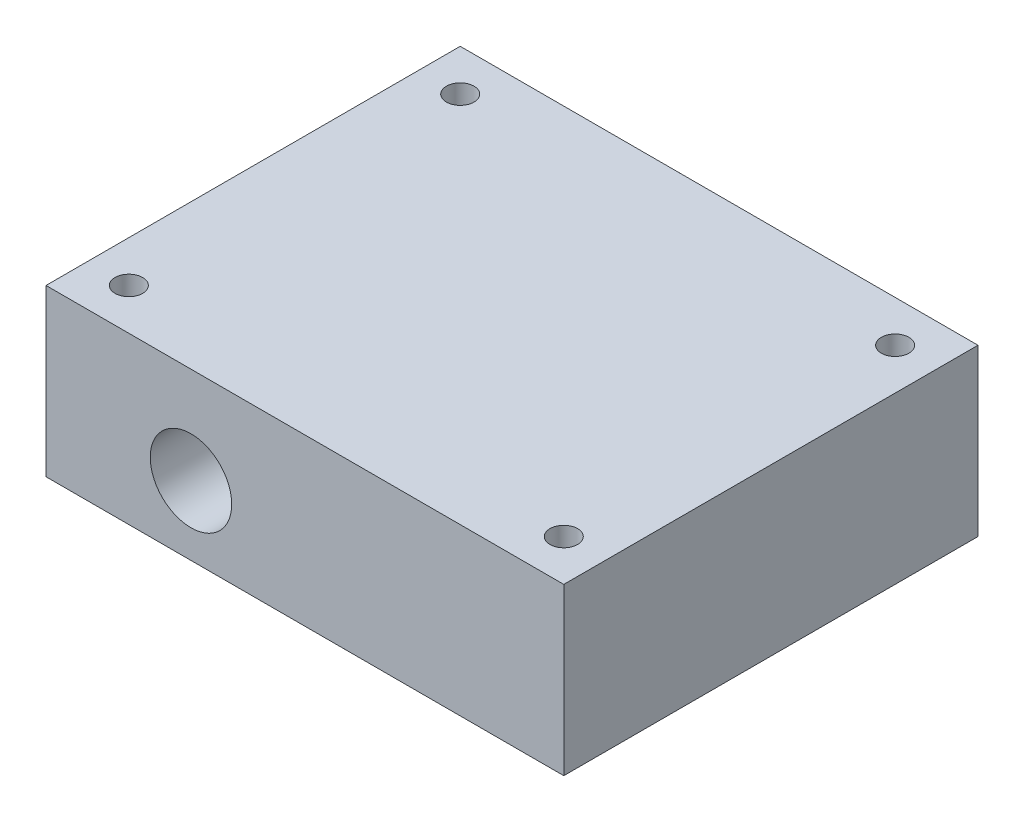
ISO-10303-21;
HEADER;
FILE_DESCRIPTION(('STEP AP214'),'2;1');
FILE_NAME('part.step','',(''),(''),'','','');
FILE_SCHEMA(('AUTOMOTIVE_DESIGN { 1 0 10303 214 1 1 1 1 }'));
ENDSEC;
DATA;
#1=APPLICATION_CONTEXT('core data for automotive mechanical design processes');
#2=APPLICATION_PROTOCOL_DEFINITION('international standard','automotive_design',2000,#1);
#3=PRODUCT_CONTEXT('',#1,'mechanical');
#4=PRODUCT('Part','Part','',(#3));
#5=PRODUCT_RELATED_PRODUCT_CATEGORY('part','',(#4));
#6=PRODUCT_DEFINITION_FORMATION('','',#4);
#7=PRODUCT_DEFINITION_CONTEXT('part definition',#1,'design');
#8=PRODUCT_DEFINITION('design','',#6,#7);
#9=PRODUCT_DEFINITION_SHAPE('','',#8);
#10=(LENGTH_UNIT() NAMED_UNIT(*) SI_UNIT(.MILLI.,.METRE.));
#11=(NAMED_UNIT(*) PLANE_ANGLE_UNIT() SI_UNIT($,.RADIAN.));
#12=(NAMED_UNIT(*) SI_UNIT($,.STERADIAN.) SOLID_ANGLE_UNIT());
#13=UNCERTAINTY_MEASURE_WITH_UNIT(LENGTH_MEASURE(1.E-05),#10,'distance_accuracy_value','');
#14=(GEOMETRIC_REPRESENTATION_CONTEXT(3) GLOBAL_UNCERTAINTY_ASSIGNED_CONTEXT((#13)) GLOBAL_UNIT_ASSIGNED_CONTEXT((#10,
#11,#12)) REPRESENTATION_CONTEXT('',''));
#15=CARTESIAN_POINT('',(0.,0.,0.));
#16=DIRECTION('',(0.,0.,1.));
#17=DIRECTION('',(1.,0.,0.));
#18=AXIS2_PLACEMENT_3D('',#15,#16,#17);
#19=CARTESIAN_POINT('',(0.,24.,0.));
#20=DIRECTION('',(1.,0.,0.));
#21=DIRECTION('',(0.,0.,-1.));
#22=AXIS2_PLACEMENT_3D('',#19,#20,#21);
#23=PLANE('',#22);
#24=DIRECTION('',(0.,0.,1.));
#25=VECTOR('',#24,1.);
#26=CARTESIAN_POINT('',(0.,0.,0.));
#27=LINE('',#26,#25);
#28=CARTESIAN_POINT('',(0.,0.,-60.));
#29=VERTEX_POINT('',#28);
#30=CARTESIAN_POINT('',(0.,0.,0.));
#31=VERTEX_POINT('',#30);
#32=EDGE_CURVE('E154',#29,#31,#27,.T.);
#33=ORIENTED_EDGE('',*,*,#32,.T.);
#34=DIRECTION('',(0.,-1.,0.));
#35=VECTOR('',#34,1.);
#36=CARTESIAN_POINT('',(0.,24.,0.));
#37=LINE('',#36,#35);
#38=CARTESIAN_POINT('',(0.,24.,0.));
#39=VERTEX_POINT('',#38);
#40=EDGE_CURVE('E11',#39,#31,#37,.T.);
#41=ORIENTED_EDGE('',*,*,#40,.F.);
#42=DIRECTION('',(0.,0.,1.));
#43=VECTOR('',#42,1.);
#44=CARTESIAN_POINT('',(0.,24.,0.));
#45=LINE('',#44,#43);
#46=CARTESIAN_POINT('',(0.,24.,-60.));
#47=VERTEX_POINT('',#46);
#48=EDGE_CURVE('E165',#47,#39,#45,.T.);
#49=ORIENTED_EDGE('',*,*,#48,.F.);
#50=DIRECTION('',(0.,-1.,0.));
#51=VECTOR('',#50,1.);
#52=CARTESIAN_POINT('',(0.,24.,-60.));
#53=LINE('',#52,#51);
#54=EDGE_CURVE('E169',#47,#29,#53,.T.);
#55=ORIENTED_EDGE('',*,*,#54,.T.);
#56=EDGE_LOOP('',(#33,#41,#49,#55));
#57=FACE_BOUND('',#56,.T.);
#58=ADVANCED_FACE('F33',(#57),#23,.F.);
#59=CARTESIAN_POINT('',(0.,24.,0.));
#60=DIRECTION('',(0.,0.,-1.));
#61=DIRECTION('',(-1.,0.,0.));
#62=AXIS2_PLACEMENT_3D('',#59,#60,#61);
#63=PLANE('',#62);
#64=CARTESIAN_POINT('',(21.,10.,0.));
#65=DIRECTION('',(0.,0.,1.));
#66=DIRECTION('',(1.,0.,0.));
#67=AXIS2_PLACEMENT_3D('',#64,#65,#66);
#68=CIRCLE('',#67,5.9);
#69=CARTESIAN_POINT('',(26.9,10.,0.));
#70=VERTEX_POINT('',#69);
#71=EDGE_CURVE('E119',#70,#70,#68,.T.);
#72=ORIENTED_EDGE('',*,*,#71,.F.);
#73=EDGE_LOOP('',(#72));
#74=FACE_BOUND('',#73,.T.);
#75=DIRECTION('',(1.,0.,0.));
#76=VECTOR('',#75,1.);
#77=CARTESIAN_POINT('',(0.,0.,0.));
#78=LINE('',#77,#76);
#79=CARTESIAN_POINT('',(75.,0.,0.));
#80=VERTEX_POINT('',#79);
#81=EDGE_CURVE('E145',#31,#80,#78,.T.);
#82=ORIENTED_EDGE('',*,*,#81,.T.);
#83=DIRECTION('',(0.,-1.,0.));
#84=VECTOR('',#83,1.);
#85=CARTESIAN_POINT('',(75.,24.,0.));
#86=LINE('',#85,#84);
#87=CARTESIAN_POINT('',(75.,24.,0.));
#88=VERTEX_POINT('',#87);
#89=EDGE_CURVE('E40',#88,#80,#86,.T.);
#90=ORIENTED_EDGE('',*,*,#89,.F.);
#91=DIRECTION('',(1.,0.,0.));
#92=VECTOR('',#91,1.);
#93=CARTESIAN_POINT('',(0.,24.,0.));
#94=LINE('',#93,#92);
#95=EDGE_CURVE('E181',#39,#88,#94,.T.);
#96=ORIENTED_EDGE('',*,*,#95,.F.);
#97=ORIENTED_EDGE('',*,*,#40,.T.);
#98=EDGE_LOOP('',(#82,#90,#96,#97));
#99=FACE_BOUND('',#98,.T.);
#100=ADVANCED_FACE('F140',(#74,#99),#63,.F.);
#101=CARTESIAN_POINT('',(75.,24.,0.));
#102=DIRECTION('',(-1.,0.,0.));
#103=DIRECTION('',(0.,0.,1.));
#104=AXIS2_PLACEMENT_3D('',#101,#102,#103);
#105=PLANE('',#104);
#106=DIRECTION('',(0.,0.,-1.));
#107=VECTOR('',#106,1.);
#108=CARTESIAN_POINT('',(75.,0.,0.));
#109=LINE('',#108,#107);
#110=CARTESIAN_POINT('',(75.,0.,-60.));
#111=VERTEX_POINT('',#110);
#112=EDGE_CURVE('E153',#80,#111,#109,.T.);
#113=ORIENTED_EDGE('',*,*,#112,.T.);
#114=DIRECTION('',(0.,-1.,0.));
#115=VECTOR('',#114,1.);
#116=CARTESIAN_POINT('',(75.,24.,-60.));
#117=LINE('',#116,#115);
#118=CARTESIAN_POINT('',(75.,24.,-60.));
#119=VERTEX_POINT('',#118);
#120=EDGE_CURVE('E160',#119,#111,#117,.T.);
#121=ORIENTED_EDGE('',*,*,#120,.F.);
#122=DIRECTION('',(0.,0.,-1.));
#123=VECTOR('',#122,1.);
#124=CARTESIAN_POINT('',(75.,24.,0.));
#125=LINE('',#124,#123);
#126=EDGE_CURVE('E159',#88,#119,#125,.T.);
#127=ORIENTED_EDGE('',*,*,#126,.F.);
#128=ORIENTED_EDGE('',*,*,#89,.T.);
#129=EDGE_LOOP('',(#113,#121,#127,#128));
#130=FACE_BOUND('',#129,.T.);
#131=ADVANCED_FACE('F143',(#130),#105,.F.);
#132=CARTESIAN_POINT('',(0.,24.,-60.));
#133=DIRECTION('',(0.,0.,1.));
#134=DIRECTION('',(1.,0.,0.));
#135=AXIS2_PLACEMENT_3D('',#132,#133,#134);
#136=PLANE('',#135);
#137=DIRECTION('',(-1.,0.,0.));
#138=VECTOR('',#137,1.);
#139=CARTESIAN_POINT('',(0.,0.,-60.));
#140=LINE('',#139,#138);
#141=EDGE_CURVE('E163',#111,#29,#140,.T.);
#142=ORIENTED_EDGE('',*,*,#141,.T.);
#143=ORIENTED_EDGE('',*,*,#54,.F.);
#144=DIRECTION('',(-1.,0.,0.));
#145=VECTOR('',#144,1.);
#146=CARTESIAN_POINT('',(0.,24.,-60.));
#147=LINE('',#146,#145);
#148=EDGE_CURVE('E172',#119,#47,#147,.T.);
#149=ORIENTED_EDGE('',*,*,#148,.F.);
#150=ORIENTED_EDGE('',*,*,#120,.T.);
#151=EDGE_LOOP('',(#142,#143,#149,#150));
#152=FACE_BOUND('',#151,.T.);
#153=ADVANCED_FACE('F175',(#152),#136,.F.);
#154=CARTESIAN_POINT('',(0.,24.,0.));
#155=DIRECTION('',(0.,-1.,0.));
#156=DIRECTION('',(0.,0.,-1.));
#157=AXIS2_PLACEMENT_3D('',#154,#155,#156);
#158=PLANE('',#157);
#159=CARTESIAN_POINT('',(6.,24.,-6.));
#160=DIRECTION('',(0.,1.,0.));
#161=DIRECTION('',(0.,0.,-1.));
#162=AXIS2_PLACEMENT_3D('',#159,#160,#161);
#163=CIRCLE('',#162,2.);
#164=CARTESIAN_POINT('',(6.,24.,-8.));
#165=VERTEX_POINT('',#164);
#166=EDGE_CURVE('E368',#165,#165,#163,.T.);
#167=ORIENTED_EDGE('',*,*,#166,.F.);
#168=EDGE_LOOP('',(#167));
#169=FACE_BOUND('',#168,.T.);
#170=CARTESIAN_POINT('',(69.,24.,-54.));
#171=DIRECTION('',(0.,1.,0.));
#172=DIRECTION('',(0.,0.,-1.));
#173=AXIS2_PLACEMENT_3D('',#170,#171,#172);
#174=CIRCLE('',#173,2.00000000000001);
#175=CARTESIAN_POINT('',(69.,24.,-56.));
#176=VERTEX_POINT('',#175);
#177=EDGE_CURVE('E374',#176,#176,#174,.T.);
#178=ORIENTED_EDGE('',*,*,#177,.F.);
#179=EDGE_LOOP('',(#178));
#180=FACE_BOUND('',#179,.T.);
#181=CARTESIAN_POINT('',(69.,24.,-6.00000000000002));
#182=DIRECTION('',(0.,1.,0.));
#183=DIRECTION('',(0.,0.,1.));
#184=AXIS2_PLACEMENT_3D('',#181,#182,#183);
#185=CIRCLE('',#184,2.00000000000001);
#186=CARTESIAN_POINT('',(69.,24.,-4.00000000000001));
#187=VERTEX_POINT('',#186);
#188=EDGE_CURVE('E195',#187,#187,#185,.T.);
#189=ORIENTED_EDGE('',*,*,#188,.F.);
#190=EDGE_LOOP('',(#189));
#191=FACE_BOUND('',#190,.T.);
#192=CARTESIAN_POINT('',(6.00000000000001,24.,-54.));
#193=DIRECTION('',(0.,1.,0.));
#194=DIRECTION('',(0.,0.,1.));
#195=AXIS2_PLACEMENT_3D('',#192,#193,#194);
#196=CIRCLE('',#195,2.);
#197=CARTESIAN_POINT('',(6.00000000000001,24.,-52.));
#198=VERTEX_POINT('',#197);
#199=EDGE_CURVE('E187',#198,#198,#196,.T.);
#200=ORIENTED_EDGE('',*,*,#199,.F.);
#201=EDGE_LOOP('',(#200));
#202=FACE_BOUND('',#201,.T.);
#203=ORIENTED_EDGE('',*,*,#48,.T.);
#204=ORIENTED_EDGE('',*,*,#95,.T.);
#205=ORIENTED_EDGE('',*,*,#126,.T.);
#206=ORIENTED_EDGE('',*,*,#148,.T.);
#207=EDGE_LOOP('',(#203,#204,#205,#206));
#208=FACE_BOUND('',#207,.T.);
#209=ADVANCED_FACE('F198',(#169,#180,#191,#202,#208),#158,.F.);
#210=CARTESIAN_POINT('',(0.,0.,0.));
#211=DIRECTION('',(0.,-1.,0.));
#212=DIRECTION('',(0.,0.,-1.));
#213=AXIS2_PLACEMENT_3D('',#210,#211,#212);
#214=PLANE('',#213);
#215=DIRECTION('',(0.,0.,-1.));
#216=VECTOR('',#215,1.);
#217=CARTESIAN_POINT('',(15.,0.,-10.));
#218=LINE('',#217,#216);
#219=CARTESIAN_POINT('',(15.,0.,-10.));
#220=VERTEX_POINT('',#219);
#221=CARTESIAN_POINT('',(15.,0.,-50.));
#222=VERTEX_POINT('',#221);
#223=EDGE_CURVE('E54',#220,#222,#218,.T.);
#224=ORIENTED_EDGE('',*,*,#223,.F.);
#225=DIRECTION('',(-1.,0.,0.));
#226=VECTOR('',#225,1.);
#227=CARTESIAN_POINT('',(15.,0.,-10.));
#228=LINE('',#227,#226);
#229=CARTESIAN_POINT('',(60.,0.,-10.));
#230=VERTEX_POINT('',#229);
#231=EDGE_CURVE('E136',#230,#220,#228,.T.);
#232=ORIENTED_EDGE('',*,*,#231,.F.);
#233=DIRECTION('',(0.,0.,1.));
#234=VECTOR('',#233,1.);
#235=CARTESIAN_POINT('',(60.,0.,-10.));
#236=LINE('',#235,#234);
#237=CARTESIAN_POINT('',(60.,0.,-50.));
#238=VERTEX_POINT('',#237);
#239=EDGE_CURVE('E352',#238,#230,#236,.T.);
#240=ORIENTED_EDGE('',*,*,#239,.F.);
#241=DIRECTION('',(1.,0.,0.));
#242=VECTOR('',#241,1.);
#243=CARTESIAN_POINT('',(15.,0.,-50.));
#244=LINE('',#243,#242);
#245=EDGE_CURVE('E349',#222,#238,#244,.T.);
#246=ORIENTED_EDGE('',*,*,#245,.F.);
#247=EDGE_LOOP('',(#224,#232,#240,#246));
#248=FACE_BOUND('',#247,.T.);
#249=CARTESIAN_POINT('',(6.,0.,-6.));
#250=DIRECTION('',(0.,1.,0.));
#251=DIRECTION('',(0.,0.,-1.));
#252=AXIS2_PLACEMENT_3D('',#249,#250,#251);
#253=CIRCLE('',#252,2.);
#254=CARTESIAN_POINT('',(6.,0.,-8.));
#255=VERTEX_POINT('',#254);
#256=EDGE_CURVE('E192',#255,#255,#253,.T.);
#257=ORIENTED_EDGE('',*,*,#256,.T.);
#258=EDGE_LOOP('',(#257));
#259=FACE_BOUND('',#258,.T.);
#260=CARTESIAN_POINT('',(69.,0.,-54.));
#261=DIRECTION('',(0.,1.,0.));
#262=DIRECTION('',(0.,0.,-1.));
#263=AXIS2_PLACEMENT_3D('',#260,#261,#262);
#264=CIRCLE('',#263,2.00000000000001);
#265=CARTESIAN_POINT('',(69.,0.,-56.));
#266=VERTEX_POINT('',#265);
#267=EDGE_CURVE('E371',#266,#266,#264,.T.);
#268=ORIENTED_EDGE('',*,*,#267,.T.);
#269=EDGE_LOOP('',(#268));
#270=FACE_BOUND('',#269,.T.);
#271=CARTESIAN_POINT('',(69.,0.,-6.00000000000002));
#272=DIRECTION('',(0.,1.,0.));
#273=DIRECTION('',(0.,0.,1.));
#274=AXIS2_PLACEMENT_3D('',#271,#272,#273);
#275=CIRCLE('',#274,2.00000000000001);
#276=CARTESIAN_POINT('',(69.,0.,-4.00000000000001));
#277=VERTEX_POINT('',#276);
#278=EDGE_CURVE('E376',#277,#277,#275,.T.);
#279=ORIENTED_EDGE('',*,*,#278,.T.);
#280=EDGE_LOOP('',(#279));
#281=FACE_BOUND('',#280,.T.);
#282=CARTESIAN_POINT('',(6.00000000000001,0.,-54.));
#283=DIRECTION('',(0.,1.,0.));
#284=DIRECTION('',(0.,0.,1.));
#285=AXIS2_PLACEMENT_3D('',#282,#283,#284);
#286=CIRCLE('',#285,2.);
#287=CARTESIAN_POINT('',(6.00000000000001,0.,-52.));
#288=VERTEX_POINT('',#287);
#289=EDGE_CURVE('E184',#288,#288,#286,.T.);
#290=ORIENTED_EDGE('',*,*,#289,.T.);
#291=EDGE_LOOP('',(#290));
#292=FACE_BOUND('',#291,.T.);
#293=ORIENTED_EDGE('',*,*,#32,.F.);
#294=ORIENTED_EDGE('',*,*,#141,.F.);
#295=ORIENTED_EDGE('',*,*,#112,.F.);
#296=ORIENTED_EDGE('',*,*,#81,.F.);
#297=EDGE_LOOP('',(#293,#294,#295,#296));
#298=FACE_BOUND('',#297,.T.);
#299=ADVANCED_FACE('F162',(#248,#259,#270,#281,#292,#298),#214,.T.);
#300=CARTESIAN_POINT('',(6.00000000000001,0.,-54.));
#301=DIRECTION('',(0.,1.,0.));
#302=DIRECTION('',(0.,0.,1.));
#303=AXIS2_PLACEMENT_3D('',#300,#301,#302);
#304=CYLINDRICAL_SURFACE('',#303,2.);
#305=ORIENTED_EDGE('',*,*,#289,.F.);
#306=EDGE_LOOP('',(#305));
#307=FACE_BOUND('',#306,.T.);
#308=ORIENTED_EDGE('',*,*,#199,.T.);
#309=EDGE_LOOP('',(#308));
#310=FACE_BOUND('',#309,.T.);
#311=ADVANCED_FACE('F234',(#307,#310),#304,.F.);
#312=CARTESIAN_POINT('',(69.,0.,-6.00000000000002));
#313=DIRECTION('',(0.,1.,0.));
#314=DIRECTION('',(0.,0.,1.));
#315=AXIS2_PLACEMENT_3D('',#312,#313,#314);
#316=CYLINDRICAL_SURFACE('',#315,2.00000000000001);
#317=ORIENTED_EDGE('',*,*,#278,.F.);
#318=EDGE_LOOP('',(#317));
#319=FACE_BOUND('',#318,.T.);
#320=ORIENTED_EDGE('',*,*,#188,.T.);
#321=EDGE_LOOP('',(#320));
#322=FACE_BOUND('',#321,.T.);
#323=ADVANCED_FACE('F243',(#319,#322),#316,.F.);
#324=CARTESIAN_POINT('',(69.,0.,-54.));
#325=DIRECTION('',(0.,1.,0.));
#326=DIRECTION('',(0.,0.,1.));
#327=AXIS2_PLACEMENT_3D('',#324,#325,#326);
#328=CYLINDRICAL_SURFACE('',#327,2.00000000000001);
#329=ORIENTED_EDGE('',*,*,#267,.F.);
#330=EDGE_LOOP('',(#329));
#331=FACE_BOUND('',#330,.T.);
#332=ORIENTED_EDGE('',*,*,#177,.T.);
#333=EDGE_LOOP('',(#332));
#334=FACE_BOUND('',#333,.T.);
#335=ADVANCED_FACE('F251',(#331,#334),#328,.F.);
#336=CARTESIAN_POINT('',(6.,0.,-6.));
#337=DIRECTION('',(0.,1.,0.));
#338=DIRECTION('',(0.,0.,1.));
#339=AXIS2_PLACEMENT_3D('',#336,#337,#338);
#340=CYLINDRICAL_SURFACE('',#339,2.);
#341=ORIENTED_EDGE('',*,*,#256,.F.);
#342=EDGE_LOOP('',(#341));
#343=FACE_BOUND('',#342,.T.);
#344=ORIENTED_EDGE('',*,*,#166,.T.);
#345=EDGE_LOOP('',(#344));
#346=FACE_BOUND('',#345,.T.);
#347=ADVANCED_FACE('F259',(#343,#346),#340,.F.);
#348=CARTESIAN_POINT('',(15.,15.,-10.));
#349=DIRECTION('',(-1.,0.,0.));
#350=DIRECTION('',(0.,0.,1.));
#351=AXIS2_PLACEMENT_3D('',#348,#349,#350);
#352=PLANE('',#351);
#353=ORIENTED_EDGE('',*,*,#223,.T.);
#354=DIRECTION('',(0.,-1.,0.));
#355=VECTOR('',#354,1.);
#356=CARTESIAN_POINT('',(15.,15.,-50.));
#357=LINE('',#356,#355);
#358=CARTESIAN_POINT('',(15.,15.,-50.));
#359=VERTEX_POINT('',#358);
#360=EDGE_CURVE('E126',#359,#222,#357,.T.);
#361=ORIENTED_EDGE('',*,*,#360,.F.);
#362=DIRECTION('',(0.,0.,-1.));
#363=VECTOR('',#362,1.);
#364=CARTESIAN_POINT('',(15.,15.,-10.));
#365=LINE('',#364,#363);
#366=CARTESIAN_POINT('',(15.,15.,-10.));
#367=VERTEX_POINT('',#366);
#368=EDGE_CURVE('E132',#367,#359,#365,.T.);
#369=ORIENTED_EDGE('',*,*,#368,.F.);
#370=DIRECTION('',(0.,-1.,0.));
#371=VECTOR('',#370,1.);
#372=CARTESIAN_POINT('',(15.,15.,-10.));
#373=LINE('',#372,#371);
#374=EDGE_CURVE('E361',#367,#220,#373,.T.);
#375=ORIENTED_EDGE('',*,*,#374,.T.);
#376=EDGE_LOOP('',(#353,#361,#369,#375));
#377=FACE_BOUND('',#376,.T.);
#378=ADVANCED_FACE('F266',(#377),#352,.F.);
#379=CARTESIAN_POINT('',(15.,15.,-10.));
#380=DIRECTION('',(0.,0.,1.));
#381=DIRECTION('',(1.,0.,0.));
#382=AXIS2_PLACEMENT_3D('',#379,#380,#381);
#383=PLANE('',#382);
#384=DIRECTION('',(-1.,0.,0.));
#385=VECTOR('',#384,1.);
#386=CARTESIAN_POINT('',(15.,15.,-10.));
#387=LINE('',#386,#385);
#388=CARTESIAN_POINT('',(17.8679080473268,15.,-10.));
#389=VERTEX_POINT('',#388);
#390=EDGE_CURVE('E106',#389,#367,#387,.T.);
#391=ORIENTED_EDGE('',*,*,#390,.F.);
#392=CARTESIAN_POINT('',(21.,10.,-10.));
#393=DIRECTION('',(0.,0.,1.));
#394=DIRECTION('',(1.,0.,0.));
#395=AXIS2_PLACEMENT_3D('',#392,#393,#394);
#396=CIRCLE('',#395,5.9);
#397=CARTESIAN_POINT('',(24.1320919526732,15.,-10.));
#398=VERTEX_POINT('',#397);
#399=EDGE_CURVE('E112',#389,#398,#396,.T.);
#400=ORIENTED_EDGE('',*,*,#399,.T.);
#401=CARTESIAN_POINT('',(60.,15.,-10.));
#402=VERTEX_POINT('',#401);
#403=EDGE_CURVE('E105',#402,#398,#387,.T.);
#404=ORIENTED_EDGE('',*,*,#403,.F.);
#405=DIRECTION('',(0.,-1.,0.));
#406=VECTOR('',#405,1.);
#407=CARTESIAN_POINT('',(60.,15.,-10.));
#408=LINE('',#407,#406);
#409=EDGE_CURVE('E363',#402,#230,#408,.T.);
#410=ORIENTED_EDGE('',*,*,#409,.T.);
#411=ORIENTED_EDGE('',*,*,#231,.T.);
#412=ORIENTED_EDGE('',*,*,#374,.F.);
#413=EDGE_LOOP('',(#391,#400,#404,#410,#411,#412));
#414=FACE_BOUND('',#413,.T.);
#415=ADVANCED_FACE('F117',(#414),#383,.F.);
#416=CARTESIAN_POINT('',(60.,15.,-10.));
#417=DIRECTION('',(1.,0.,0.));
#418=DIRECTION('',(0.,0.,-1.));
#419=AXIS2_PLACEMENT_3D('',#416,#417,#418);
#420=PLANE('',#419);
#421=ORIENTED_EDGE('',*,*,#239,.T.);
#422=ORIENTED_EDGE('',*,*,#409,.F.);
#423=DIRECTION('',(0.,0.,1.));
#424=VECTOR('',#423,1.);
#425=CARTESIAN_POINT('',(60.,15.,-10.));
#426=LINE('',#425,#424);
#427=CARTESIAN_POINT('',(60.,15.,-50.));
#428=VERTEX_POINT('',#427);
#429=EDGE_CURVE('E125',#428,#402,#426,.T.);
#430=ORIENTED_EDGE('',*,*,#429,.F.);
#431=DIRECTION('',(0.,-1.,0.));
#432=VECTOR('',#431,1.);
#433=CARTESIAN_POINT('',(60.,15.,-50.));
#434=LINE('',#433,#432);
#435=EDGE_CURVE('E127',#428,#238,#434,.T.);
#436=ORIENTED_EDGE('',*,*,#435,.T.);
#437=EDGE_LOOP('',(#421,#422,#430,#436));
#438=FACE_BOUND('',#437,.T.);
#439=ADVANCED_FACE('F279',(#438),#420,.F.);
#440=CARTESIAN_POINT('',(15.,15.,-50.));
#441=DIRECTION('',(0.,0.,-1.));
#442=DIRECTION('',(-1.,0.,0.));
#443=AXIS2_PLACEMENT_3D('',#440,#441,#442);
#444=PLANE('',#443);
#445=ORIENTED_EDGE('',*,*,#245,.T.);
#446=ORIENTED_EDGE('',*,*,#435,.F.);
#447=DIRECTION('',(1.,0.,0.));
#448=VECTOR('',#447,1.);
#449=CARTESIAN_POINT('',(15.,15.,-50.));
#450=LINE('',#449,#448);
#451=EDGE_CURVE('E131',#359,#428,#450,.T.);
#452=ORIENTED_EDGE('',*,*,#451,.F.);
#453=ORIENTED_EDGE('',*,*,#360,.T.);
#454=EDGE_LOOP('',(#445,#446,#452,#453));
#455=FACE_BOUND('',#454,.T.);
#456=ADVANCED_FACE('F286',(#455),#444,.F.);
#457=CARTESIAN_POINT('',(0.,15.,0.));
#458=DIRECTION('',(0.,-1.,0.));
#459=DIRECTION('',(0.,0.,-1.));
#460=AXIS2_PLACEMENT_3D('',#457,#458,#459);
#461=PLANE('',#460);
#462=ORIENTED_EDGE('',*,*,#368,.T.);
#463=ORIENTED_EDGE('',*,*,#451,.T.);
#464=ORIENTED_EDGE('',*,*,#429,.T.);
#465=ORIENTED_EDGE('',*,*,#403,.T.);
#466=EDGE_CURVE('E101',#398,#389,#387,.T.);
#467=ORIENTED_EDGE('',*,*,#466,.T.);
#468=ORIENTED_EDGE('',*,*,#390,.T.);
#469=EDGE_LOOP('',(#462,#463,#464,#465,#467,#468));
#470=FACE_BOUND('',#469,.T.);
#471=ADVANCED_FACE('F122',(#470),#461,.T.);
#472=CARTESIAN_POINT('',(21.,10.,-10.));
#473=DIRECTION('',(0.,0.,1.));
#474=DIRECTION('',(1.,0.,0.));
#475=AXIS2_PLACEMENT_3D('',#472,#473,#474);
#476=PLANE('',#475);
#477=EDGE_CURVE('E46',#398,#389,#396,.T.);
#478=ORIENTED_EDGE('',*,*,#477,.T.);
#479=ORIENTED_EDGE('',*,*,#466,.F.);
#480=EDGE_LOOP('',(#478,#479));
#481=FACE_BOUND('',#480,.T.);
#482=ADVANCED_FACE('F102',(#481),#476,.T.);
#483=CARTESIAN_POINT('',(21.,10.,-10.));
#484=DIRECTION('',(0.,0.,1.));
#485=DIRECTION('',(1.,0.,0.));
#486=AXIS2_PLACEMENT_3D('',#483,#484,#485);
#487=CYLINDRICAL_SURFACE('',#486,5.9);
#488=ORIENTED_EDGE('',*,*,#477,.F.);
#489=ORIENTED_EDGE('',*,*,#399,.F.);
#490=EDGE_LOOP('',(#488,#489));
#491=FACE_BOUND('',#490,.T.);
#492=ORIENTED_EDGE('',*,*,#71,.T.);
#493=EDGE_LOOP('',(#492));
#494=FACE_BOUND('',#493,.T.);
#495=ADVANCED_FACE('F110',(#491,#494),#487,.F.);
#496=CLOSED_SHELL('',(#58,#100,#131,#153,#209,#299,#311,#323,#335,#347,#378,#415,#439,#456,#471,
#482,#495));
#497=MANIFOLD_SOLID_BREP('B2',#496);
#498=ADVANCED_BREP_SHAPE_REPRESENTATION('',(#18,#497),#14);
#499=SHAPE_DEFINITION_REPRESENTATION(#9,#498);
ENDSEC;
END-ISO-10303-21;
